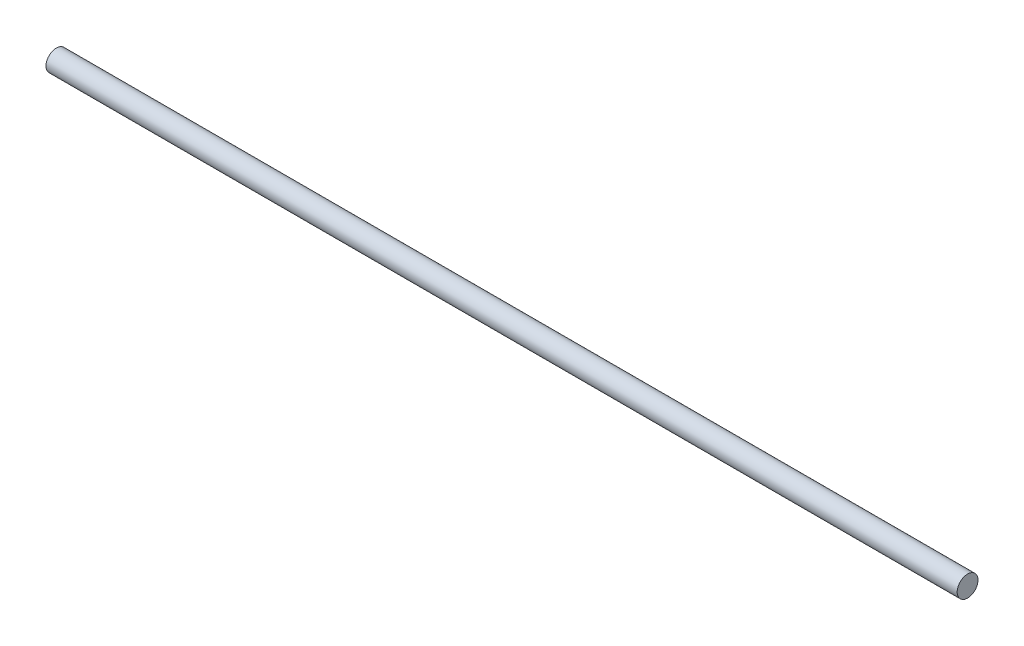
ISO-10303-21;
HEADER;
FILE_DESCRIPTION(('STEP AP214'),'2;1');
FILE_NAME('part.step','',(''),(''),'','','');
FILE_SCHEMA(('AUTOMOTIVE_DESIGN { 1 0 10303 214 1 1 1 1 }'));
ENDSEC;
DATA;
#1=APPLICATION_CONTEXT('core data for automotive mechanical design processes');
#2=APPLICATION_PROTOCOL_DEFINITION('international standard','automotive_design',2000,#1);
#3=PRODUCT_CONTEXT('',#1,'mechanical');
#4=PRODUCT('Part','Part','',(#3));
#5=PRODUCT_RELATED_PRODUCT_CATEGORY('part','',(#4));
#6=PRODUCT_DEFINITION_FORMATION('','',#4);
#7=PRODUCT_DEFINITION_CONTEXT('part definition',#1,'design');
#8=PRODUCT_DEFINITION('design','',#6,#7);
#9=PRODUCT_DEFINITION_SHAPE('','',#8);
#10=(LENGTH_UNIT() NAMED_UNIT(*) SI_UNIT(.MILLI.,.METRE.));
#11=(NAMED_UNIT(*) PLANE_ANGLE_UNIT() SI_UNIT($,.RADIAN.));
#12=(NAMED_UNIT(*) SI_UNIT($,.STERADIAN.) SOLID_ANGLE_UNIT());
#13=UNCERTAINTY_MEASURE_WITH_UNIT(LENGTH_MEASURE(1.E-05),#10,'distance_accuracy_value','');
#14=(GEOMETRIC_REPRESENTATION_CONTEXT(3) GLOBAL_UNCERTAINTY_ASSIGNED_CONTEXT((#13)) GLOBAL_UNIT_ASSIGNED_CONTEXT((#10,
#11,#12)) REPRESENTATION_CONTEXT('',''));
#15=CARTESIAN_POINT('',(0.,0.,0.));
#16=DIRECTION('',(0.,0.,1.));
#17=DIRECTION('',(1.,0.,0.));
#18=AXIS2_PLACEMENT_3D('',#15,#16,#17);
#19=CARTESIAN_POINT('',(350.,0.,0.));
#20=DIRECTION('',(-1.,0.,0.));
#21=DIRECTION('',(0.,0.,1.));
#22=AXIS2_PLACEMENT_3D('',#19,#20,#21);
#23=CYLINDRICAL_SURFACE('',#22,4.);
#24=CARTESIAN_POINT('',(350.,0.,0.));
#25=DIRECTION('',(1.,0.,0.));
#26=DIRECTION('',(0.,0.,-1.));
#27=AXIS2_PLACEMENT_3D('',#24,#25,#26);
#28=CIRCLE('',#27,4.);
#29=CARTESIAN_POINT('',(350.,0.,-4.));
#30=VERTEX_POINT('',#29);
#31=EDGE_CURVE('E10',#30,#30,#28,.T.);
#32=ORIENTED_EDGE('',*,*,#31,.F.);
#33=EDGE_LOOP('',(#32));
#34=FACE_BOUND('',#33,.T.);
#35=CARTESIAN_POINT('',(0.,0.,0.));
#36=DIRECTION('',(1.,0.,0.));
#37=DIRECTION('',(0.,0.,-1.));
#38=AXIS2_PLACEMENT_3D('',#35,#36,#37);
#39=CIRCLE('',#38,4.);
#40=CARTESIAN_POINT('',(0.,0.,-4.));
#41=VERTEX_POINT('',#40);
#42=EDGE_CURVE('E33',#41,#41,#39,.T.);
#43=ORIENTED_EDGE('',*,*,#42,.T.);
#44=EDGE_LOOP('',(#43));
#45=FACE_BOUND('',#44,.T.);
#46=ADVANCED_FACE('F30',(#34,#45),#23,.T.);
#47=CARTESIAN_POINT('',(350.,0.,0.));
#48=DIRECTION('',(1.,0.,0.));
#49=DIRECTION('',(0.,0.,-1.));
#50=AXIS2_PLACEMENT_3D('',#47,#48,#49);
#51=PLANE('',#50);
#52=ORIENTED_EDGE('',*,*,#31,.T.);
#53=EDGE_LOOP('',(#52));
#54=FACE_BOUND('',#53,.T.);
#55=ADVANCED_FACE('F45',(#54),#51,.T.);
#56=CARTESIAN_POINT('',(0.,0.,0.));
#57=DIRECTION('',(1.,0.,0.));
#58=DIRECTION('',(0.,0.,-1.));
#59=AXIS2_PLACEMENT_3D('',#56,#57,#58);
#60=PLANE('',#59);
#61=ORIENTED_EDGE('',*,*,#42,.F.);
#62=EDGE_LOOP('',(#61));
#63=FACE_BOUND('',#62,.T.);
#64=ADVANCED_FACE('F43',(#63),#60,.F.);
#65=CLOSED_SHELL('',(#46,#55,#64));
#66=MANIFOLD_SOLID_BREP('B2',#65);
#67=ADVANCED_BREP_SHAPE_REPRESENTATION('',(#18,#66),#14);
#68=SHAPE_DEFINITION_REPRESENTATION(#9,#67);
ENDSEC;
END-ISO-10303-21;
